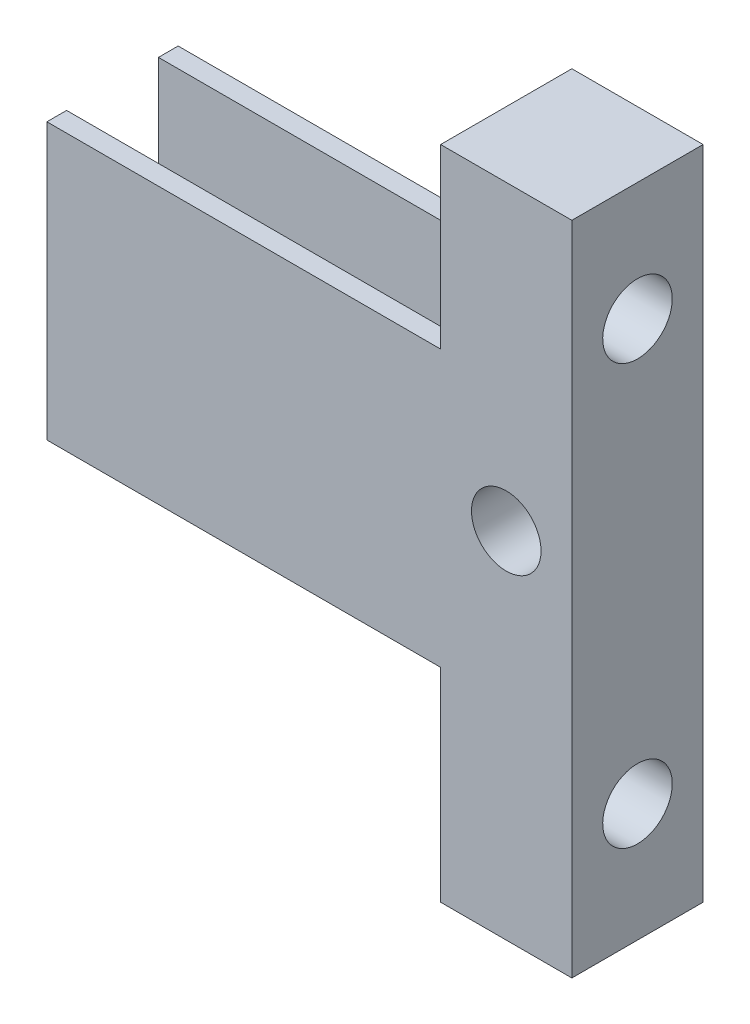
ISO-10303-21;
HEADER;
FILE_DESCRIPTION(('STEP AP214'),'2;1');
FILE_NAME('part.step','',(''),(''),'','','');
FILE_SCHEMA(('AUTOMOTIVE_DESIGN { 1 0 10303 214 1 1 1 1 }'));
ENDSEC;
DATA;
#1=APPLICATION_CONTEXT('core data for automotive mechanical design processes');
#2=APPLICATION_PROTOCOL_DEFINITION('international standard','automotive_design',2000,#1);
#3=PRODUCT_CONTEXT('',#1,'mechanical');
#4=PRODUCT('Part','Part','',(#3));
#5=PRODUCT_RELATED_PRODUCT_CATEGORY('part','',(#4));
#6=PRODUCT_DEFINITION_FORMATION('','',#4);
#7=PRODUCT_DEFINITION_CONTEXT('part definition',#1,'design');
#8=PRODUCT_DEFINITION('design','',#6,#7);
#9=PRODUCT_DEFINITION_SHAPE('','',#8);
#10=(LENGTH_UNIT() NAMED_UNIT(*) SI_UNIT(.MILLI.,.METRE.));
#11=(NAMED_UNIT(*) PLANE_ANGLE_UNIT() SI_UNIT($,.RADIAN.));
#12=(NAMED_UNIT(*) SI_UNIT($,.STERADIAN.) SOLID_ANGLE_UNIT());
#13=UNCERTAINTY_MEASURE_WITH_UNIT(LENGTH_MEASURE(1.E-05),#10,'distance_accuracy_value','');
#14=(GEOMETRIC_REPRESENTATION_CONTEXT(3) GLOBAL_UNCERTAINTY_ASSIGNED_CONTEXT((#13)) GLOBAL_UNIT_ASSIGNED_CONTEXT((#10,
#11,#12)) REPRESENTATION_CONTEXT('',''));
#15=CARTESIAN_POINT('',(0.,0.,0.));
#16=DIRECTION('',(0.,0.,1.));
#17=DIRECTION('',(1.,0.,0.));
#18=AXIS2_PLACEMENT_3D('',#15,#16,#17);
#19=CARTESIAN_POINT('',(0.,0.,10.));
#20=DIRECTION('',(-1.,0.,0.));
#21=DIRECTION('',(0.,-1.,0.));
#22=AXIS2_PLACEMENT_3D('',#19,#20,#21);
#23=PLANE('',#22);
#24=CARTESIAN_POINT('',(0.,41.,5.));
#25=DIRECTION('',(-1.,0.,0.));
#26=DIRECTION('',(0.,-1.,0.));
#27=AXIS2_PLACEMENT_3D('',#24,#25,#26);
#28=CIRCLE('',#27,2.65);
#29=CARTESIAN_POINT('',(0.,38.35,5.));
#30=VERTEX_POINT('',#29);
#31=EDGE_CURVE('E184',#30,#30,#28,.T.);
#32=ORIENTED_EDGE('',*,*,#31,.F.);
#33=EDGE_LOOP('',(#32));
#34=FACE_BOUND('',#33,.T.);
#35=CARTESIAN_POINT('',(0.,9.,5.));
#36=DIRECTION('',(-1.,0.,0.));
#37=DIRECTION('',(0.,-1.,0.));
#38=AXIS2_PLACEMENT_3D('',#35,#36,#37);
#39=CIRCLE('',#38,2.65);
#40=CARTESIAN_POINT('',(0.,6.35,5.));
#41=VERTEX_POINT('',#40);
#42=EDGE_CURVE('E179',#41,#41,#39,.T.);
#43=ORIENTED_EDGE('',*,*,#42,.F.);
#44=EDGE_LOOP('',(#43));
#45=FACE_BOUND('',#44,.T.);
#46=DIRECTION('',(0.,1.,0.));
#47=VECTOR('',#46,1.);
#48=CARTESIAN_POINT('',(0.,0.,0.));
#49=LINE('',#48,#47);
#50=CARTESIAN_POINT('',(0.,36.5,0.));
#51=VERTEX_POINT('',#50);
#52=CARTESIAN_POINT('',(0.,50.,0.));
#53=VERTEX_POINT('',#52);
#54=EDGE_CURVE('E215',#51,#53,#49,.T.);
#55=ORIENTED_EDGE('',*,*,#54,.F.);
#56=DIRECTION('',(0.,0.,-1.));
#57=VECTOR('',#56,1.);
#58=CARTESIAN_POINT('',(0.,36.5,0.));
#59=LINE('',#58,#57);
#60=CARTESIAN_POINT('',(0.,36.5,1.5));
#61=VERTEX_POINT('',#60);
#62=EDGE_CURVE('E52',#61,#51,#59,.T.);
#63=ORIENTED_EDGE('',*,*,#62,.F.);
#64=DIRECTION('',(0.,1.,0.));
#65=VECTOR('',#64,1.);
#66=CARTESIAN_POINT('',(0.,36.5,1.5));
#67=LINE('',#66,#65);
#68=CARTESIAN_POINT('',(0.,15.5,1.5));
#69=VERTEX_POINT('',#68);
#70=EDGE_CURVE('E144',#69,#61,#67,.T.);
#71=ORIENTED_EDGE('',*,*,#70,.F.);
#72=DIRECTION('',(0.,0.,1.));
#73=VECTOR('',#72,1.);
#74=CARTESIAN_POINT('',(0.,15.5,1.5));
#75=LINE('',#74,#73);
#76=CARTESIAN_POINT('',(0.,15.5,0.));
#77=VERTEX_POINT('',#76);
#78=EDGE_CURVE('E400',#77,#69,#75,.T.);
#79=ORIENTED_EDGE('',*,*,#78,.F.);
#80=CARTESIAN_POINT('',(0.,0.,0.));
#81=VERTEX_POINT('',#80);
#82=EDGE_CURVE('E216',#81,#77,#49,.T.);
#83=ORIENTED_EDGE('',*,*,#82,.F.);
#84=DIRECTION('',(0.,0.,-1.));
#85=VECTOR('',#84,1.);
#86=CARTESIAN_POINT('',(0.,0.,10.));
#87=LINE('',#86,#85);
#88=CARTESIAN_POINT('',(0.,0.,10.));
#89=VERTEX_POINT('',#88);
#90=EDGE_CURVE('E221',#89,#81,#87,.T.);
#91=ORIENTED_EDGE('',*,*,#90,.F.);
#92=DIRECTION('',(0.,1.,0.));
#93=VECTOR('',#92,1.);
#94=CARTESIAN_POINT('',(0.,0.,10.));
#95=LINE('',#94,#93);
#96=CARTESIAN_POINT('',(0.,15.5,10.));
#97=VERTEX_POINT('',#96);
#98=EDGE_CURVE('E206',#89,#97,#95,.T.);
#99=ORIENTED_EDGE('',*,*,#98,.T.);
#100=DIRECTION('',(0.,0.,1.));
#101=VECTOR('',#100,1.);
#102=CARTESIAN_POINT('',(0.,15.5,8.5));
#103=LINE('',#102,#101);
#104=CARTESIAN_POINT('',(0.,15.5,8.5));
#105=VERTEX_POINT('',#104);
#106=EDGE_CURVE('E159',#105,#97,#103,.T.);
#107=ORIENTED_EDGE('',*,*,#106,.F.);
#108=DIRECTION('',(0.,-1.,0.));
#109=VECTOR('',#108,1.);
#110=CARTESIAN_POINT('',(0.,36.5,8.5));
#111=LINE('',#110,#109);
#112=CARTESIAN_POINT('',(0.,36.5,8.5));
#113=VERTEX_POINT('',#112);
#114=EDGE_CURVE('E60',#113,#105,#111,.T.);
#115=ORIENTED_EDGE('',*,*,#114,.F.);
#116=DIRECTION('',(0.,0.,-1.));
#117=VECTOR('',#116,1.);
#118=CARTESIAN_POINT('',(0.,36.5,10.));
#119=LINE('',#118,#117);
#120=CARTESIAN_POINT('',(0.,36.5,10.));
#121=VERTEX_POINT('',#120);
#122=EDGE_CURVE('E147',#121,#113,#119,.T.);
#123=ORIENTED_EDGE('',*,*,#122,.F.);
#124=CARTESIAN_POINT('',(0.,50.,10.));
#125=VERTEX_POINT('',#124);
#126=EDGE_CURVE('E205',#121,#125,#95,.T.);
#127=ORIENTED_EDGE('',*,*,#126,.T.);
#128=DIRECTION('',(0.,0.,-1.));
#129=VECTOR('',#128,1.);
#130=CARTESIAN_POINT('',(0.,50.,10.));
#131=LINE('',#130,#129);
#132=EDGE_CURVE('E44',#125,#53,#131,.T.);
#133=ORIENTED_EDGE('',*,*,#132,.T.);
#134=EDGE_LOOP('',(#55,#63,#71,#79,#83,#91,#99,#107,#115,#123,#127,#133));
#135=FACE_BOUND('',#134,.T.);
#136=ADVANCED_FACE('F35',(#34,#45,#135),#23,.T.);
#137=CARTESIAN_POINT('',(9.99999999999999,50.,10.));
#138=DIRECTION('',(1.,0.,0.));
#139=DIRECTION('',(0.,1.,0.));
#140=AXIS2_PLACEMENT_3D('',#137,#138,#139);
#141=PLANE('',#140);
#142=CARTESIAN_POINT('',(10.,41.,5.));
#143=DIRECTION('',(-1.,0.,0.));
#144=DIRECTION('',(0.,-1.,0.));
#145=AXIS2_PLACEMENT_3D('',#142,#143,#144);
#146=CIRCLE('',#145,2.65);
#147=CARTESIAN_POINT('',(10.,38.35,5.));
#148=VERTEX_POINT('',#147);
#149=EDGE_CURVE('E180',#148,#148,#146,.T.);
#150=ORIENTED_EDGE('',*,*,#149,.T.);
#151=EDGE_LOOP('',(#150));
#152=FACE_BOUND('',#151,.T.);
#153=CARTESIAN_POINT('',(10.,9.,5.));
#154=DIRECTION('',(-1.,0.,0.));
#155=DIRECTION('',(0.,-1.,0.));
#156=AXIS2_PLACEMENT_3D('',#153,#154,#155);
#157=CIRCLE('',#156,2.65);
#158=CARTESIAN_POINT('',(10.,6.35,5.));
#159=VERTEX_POINT('',#158);
#160=EDGE_CURVE('E187',#159,#159,#157,.T.);
#161=ORIENTED_EDGE('',*,*,#160,.T.);
#162=EDGE_LOOP('',(#161));
#163=FACE_BOUND('',#162,.T.);
#164=DIRECTION('',(0.,-1.,0.));
#165=VECTOR('',#164,1.);
#166=CARTESIAN_POINT('',(9.99999999999999,50.,0.));
#167=LINE('',#166,#165);
#168=CARTESIAN_POINT('',(9.99999999999999,50.,0.));
#169=VERTEX_POINT('',#168);
#170=CARTESIAN_POINT('',(10.,0.,0.));
#171=VERTEX_POINT('',#170);
#172=EDGE_CURVE('E195',#169,#171,#167,.T.);
#173=ORIENTED_EDGE('',*,*,#172,.F.);
#174=DIRECTION('',(0.,0.,-1.));
#175=VECTOR('',#174,1.);
#176=CARTESIAN_POINT('',(9.99999999999999,50.,10.));
#177=LINE('',#176,#175);
#178=CARTESIAN_POINT('',(9.99999999999999,50.,10.));
#179=VERTEX_POINT('',#178);
#180=EDGE_CURVE('E11',#179,#169,#177,.T.);
#181=ORIENTED_EDGE('',*,*,#180,.F.);
#182=DIRECTION('',(0.,-1.,0.));
#183=VECTOR('',#182,1.);
#184=CARTESIAN_POINT('',(9.99999999999999,50.,10.));
#185=LINE('',#184,#183);
#186=CARTESIAN_POINT('',(10.,0.,10.));
#187=VERTEX_POINT('',#186);
#188=EDGE_CURVE('E198',#179,#187,#185,.T.);
#189=ORIENTED_EDGE('',*,*,#188,.T.);
#190=DIRECTION('',(0.,0.,-1.));
#191=VECTOR('',#190,1.);
#192=CARTESIAN_POINT('',(10.,0.,10.));
#193=LINE('',#192,#191);
#194=EDGE_CURVE('E39',#187,#171,#193,.T.);
#195=ORIENTED_EDGE('',*,*,#194,.T.);
#196=EDGE_LOOP('',(#173,#181,#189,#195));
#197=FACE_BOUND('',#196,.T.);
#198=ADVANCED_FACE('F37',(#152,#163,#197),#141,.T.);
#199=CARTESIAN_POINT('',(0.,50.,10.));
#200=DIRECTION('',(0.,1.,0.));
#201=DIRECTION('',(0.,0.,1.));
#202=AXIS2_PLACEMENT_3D('',#199,#200,#201);
#203=PLANE('',#202);
#204=DIRECTION('',(1.,0.,0.));
#205=VECTOR('',#204,1.);
#206=CARTESIAN_POINT('',(0.,50.,0.));
#207=LINE('',#206,#205);
#208=EDGE_CURVE('E202',#53,#169,#207,.T.);
#209=ORIENTED_EDGE('',*,*,#208,.F.);
#210=ORIENTED_EDGE('',*,*,#132,.F.);
#211=DIRECTION('',(1.,0.,0.));
#212=VECTOR('',#211,1.);
#213=CARTESIAN_POINT('',(0.,50.,10.));
#214=LINE('',#213,#212);
#215=EDGE_CURVE('E208',#125,#179,#214,.T.);
#216=ORIENTED_EDGE('',*,*,#215,.T.);
#217=ORIENTED_EDGE('',*,*,#180,.T.);
#218=EDGE_LOOP('',(#209,#210,#216,#217));
#219=FACE_BOUND('',#218,.T.);
#220=ADVANCED_FACE('F233',(#219),#203,.T.);
#221=CARTESIAN_POINT('',(10.,0.,10.));
#222=DIRECTION('',(0.,-1.,0.));
#223=DIRECTION('',(1.,0.,0.));
#224=AXIS2_PLACEMENT_3D('',#221,#222,#223);
#225=PLANE('',#224);
#226=DIRECTION('',(-1.,0.,0.));
#227=VECTOR('',#226,1.);
#228=CARTESIAN_POINT('',(10.,0.,0.));
#229=LINE('',#228,#227);
#230=EDGE_CURVE('E212',#171,#81,#229,.T.);
#231=ORIENTED_EDGE('',*,*,#230,.F.);
#232=ORIENTED_EDGE('',*,*,#194,.F.);
#233=DIRECTION('',(-1.,0.,0.));
#234=VECTOR('',#233,1.);
#235=CARTESIAN_POINT('',(10.,0.,10.));
#236=LINE('',#235,#234);
#237=EDGE_CURVE('E201',#187,#89,#236,.T.);
#238=ORIENTED_EDGE('',*,*,#237,.T.);
#239=ORIENTED_EDGE('',*,*,#90,.T.);
#240=EDGE_LOOP('',(#231,#232,#238,#239));
#241=FACE_BOUND('',#240,.T.);
#242=ADVANCED_FACE('F229',(#241),#225,.T.);
#243=CARTESIAN_POINT('',(0.,0.,10.));
#244=DIRECTION('',(0.,0.,-1.));
#245=DIRECTION('',(-1.,0.,0.));
#246=AXIS2_PLACEMENT_3D('',#243,#244,#245);
#247=PLANE('',#246);
#248=CARTESIAN_POINT('',(4.99999999999999,27.,10.));
#249=DIRECTION('',(0.,0.,1.));
#250=DIRECTION('',(1.,0.,0.));
#251=AXIS2_PLACEMENT_3D('',#248,#249,#250);
#252=CIRCLE('',#251,2.65);
#253=CARTESIAN_POINT('',(7.64999999999999,27.,10.));
#254=VERTEX_POINT('',#253);
#255=EDGE_CURVE('E183',#254,#254,#252,.T.);
#256=ORIENTED_EDGE('',*,*,#255,.F.);
#257=EDGE_LOOP('',(#256));
#258=FACE_BOUND('',#257,.T.);
#259=ORIENTED_EDGE('',*,*,#188,.F.);
#260=ORIENTED_EDGE('',*,*,#215,.F.);
#261=ORIENTED_EDGE('',*,*,#126,.F.);
#262=DIRECTION('',(1.,0.,0.));
#263=VECTOR('',#262,1.);
#264=CARTESIAN_POINT('',(-30.,36.5,10.));
#265=LINE('',#264,#263);
#266=CARTESIAN_POINT('',(-30.,36.5,10.));
#267=VERTEX_POINT('',#266);
#268=EDGE_CURVE('E164',#267,#121,#265,.T.);
#269=ORIENTED_EDGE('',*,*,#268,.F.);
#270=DIRECTION('',(0.,1.,0.));
#271=VECTOR('',#270,1.);
#272=CARTESIAN_POINT('',(-30.,15.5,10.));
#273=LINE('',#272,#271);
#274=CARTESIAN_POINT('',(-30.,15.5,10.));
#275=VERTEX_POINT('',#274);
#276=EDGE_CURVE('E163',#275,#267,#273,.T.);
#277=ORIENTED_EDGE('',*,*,#276,.F.);
#278=DIRECTION('',(1.,0.,0.));
#279=VECTOR('',#278,1.);
#280=CARTESIAN_POINT('',(-30.,15.5,10.));
#281=LINE('',#280,#279);
#282=EDGE_CURVE('E171',#275,#97,#281,.T.);
#283=ORIENTED_EDGE('',*,*,#282,.T.);
#284=ORIENTED_EDGE('',*,*,#98,.F.);
#285=ORIENTED_EDGE('',*,*,#237,.F.);
#286=EDGE_LOOP('',(#259,#260,#261,#269,#277,#283,#284,#285));
#287=FACE_BOUND('',#286,.T.);
#288=ADVANCED_FACE('F236',(#258,#287),#247,.F.);
#289=CARTESIAN_POINT('',(0.,0.,0.));
#290=DIRECTION('',(0.,0.,-1.));
#291=DIRECTION('',(-1.,0.,0.));
#292=AXIS2_PLACEMENT_3D('',#289,#290,#291);
#293=PLANE('',#292);
#294=CARTESIAN_POINT('',(4.99999999999999,27.,0.));
#295=DIRECTION('',(0.,0.,1.));
#296=DIRECTION('',(1.,0.,0.));
#297=AXIS2_PLACEMENT_3D('',#294,#295,#296);
#298=CIRCLE('',#297,2.65);
#299=CARTESIAN_POINT('',(7.64999999999999,27.,0.));
#300=VERTEX_POINT('',#299);
#301=EDGE_CURVE('E192',#300,#300,#298,.T.);
#302=ORIENTED_EDGE('',*,*,#301,.T.);
#303=EDGE_LOOP('',(#302));
#304=FACE_BOUND('',#303,.T.);
#305=ORIENTED_EDGE('',*,*,#172,.T.);
#306=ORIENTED_EDGE('',*,*,#230,.T.);
#307=ORIENTED_EDGE('',*,*,#82,.T.);
#308=DIRECTION('',(1.,0.,0.));
#309=VECTOR('',#308,1.);
#310=CARTESIAN_POINT('',(-30.,15.5,0.));
#311=LINE('',#310,#309);
#312=CARTESIAN_POINT('',(-30.,15.5,0.));
#313=VERTEX_POINT('',#312);
#314=EDGE_CURVE('E133',#313,#77,#311,.T.);
#315=ORIENTED_EDGE('',*,*,#314,.F.);
#316=DIRECTION('',(0.,-1.,0.));
#317=VECTOR('',#316,1.);
#318=CARTESIAN_POINT('',(-30.,15.5,0.));
#319=LINE('',#318,#317);
#320=CARTESIAN_POINT('',(-30.,36.5,0.));
#321=VERTEX_POINT('',#320);
#322=EDGE_CURVE('E126',#321,#313,#319,.T.);
#323=ORIENTED_EDGE('',*,*,#322,.F.);
#324=DIRECTION('',(1.,0.,0.));
#325=VECTOR('',#324,1.);
#326=CARTESIAN_POINT('',(-30.,36.5,0.));
#327=LINE('',#326,#325);
#328=EDGE_CURVE('E130',#321,#51,#327,.T.);
#329=ORIENTED_EDGE('',*,*,#328,.T.);
#330=ORIENTED_EDGE('',*,*,#54,.T.);
#331=ORIENTED_EDGE('',*,*,#208,.T.);
#332=EDGE_LOOP('',(#305,#306,#307,#315,#323,#329,#330,#331));
#333=FACE_BOUND('',#332,.T.);
#334=ADVANCED_FACE('F129',(#304,#333),#293,.T.);
#335=CARTESIAN_POINT('',(4.99999999999999,27.,0.));
#336=DIRECTION('',(0.,0.,1.));
#337=DIRECTION('',(1.,0.,0.));
#338=AXIS2_PLACEMENT_3D('',#335,#336,#337);
#339=CYLINDRICAL_SURFACE('',#338,2.65);
#340=ORIENTED_EDGE('',*,*,#301,.F.);
#341=EDGE_LOOP('',(#340));
#342=FACE_BOUND('',#341,.T.);
#343=ORIENTED_EDGE('',*,*,#255,.T.);
#344=EDGE_LOOP('',(#343));
#345=FACE_BOUND('',#344,.T.);
#346=ADVANCED_FACE('F293',(#342,#345),#339,.F.);
#347=CARTESIAN_POINT('',(10.,9.,5.));
#348=DIRECTION('',(-1.,0.,0.));
#349=DIRECTION('',(0.,-1.,0.));
#350=AXIS2_PLACEMENT_3D('',#347,#348,#349);
#351=CYLINDRICAL_SURFACE('',#350,2.65);
#352=ORIENTED_EDGE('',*,*,#160,.F.);
#353=EDGE_LOOP('',(#352));
#354=FACE_BOUND('',#353,.T.);
#355=ORIENTED_EDGE('',*,*,#42,.T.);
#356=EDGE_LOOP('',(#355));
#357=FACE_BOUND('',#356,.T.);
#358=ADVANCED_FACE('F297',(#354,#357),#351,.F.);
#359=CARTESIAN_POINT('',(10.,41.,5.));
#360=DIRECTION('',(-1.,0.,0.));
#361=DIRECTION('',(0.,-1.,0.));
#362=AXIS2_PLACEMENT_3D('',#359,#360,#361);
#363=CYLINDRICAL_SURFACE('',#362,2.65);
#364=ORIENTED_EDGE('',*,*,#149,.F.);
#365=EDGE_LOOP('',(#364));
#366=FACE_BOUND('',#365,.T.);
#367=ORIENTED_EDGE('',*,*,#31,.T.);
#368=EDGE_LOOP('',(#367));
#369=FACE_BOUND('',#368,.T.);
#370=ADVANCED_FACE('F302',(#366,#369),#363,.F.);
#371=CARTESIAN_POINT('',(-30.,36.5,10.));
#372=DIRECTION('',(0.,-1.,0.));
#373=DIRECTION('',(1.,0.,0.));
#374=AXIS2_PLACEMENT_3D('',#371,#372,#373);
#375=PLANE('',#374);
#376=ORIENTED_EDGE('',*,*,#122,.T.);
#377=DIRECTION('',(1.,0.,0.));
#378=VECTOR('',#377,1.);
#379=CARTESIAN_POINT('',(-30.,36.5,8.5));
#380=LINE('',#379,#378);
#381=CARTESIAN_POINT('',(-30.,36.5,8.5));
#382=VERTEX_POINT('',#381);
#383=EDGE_CURVE('E177',#382,#113,#380,.T.);
#384=ORIENTED_EDGE('',*,*,#383,.F.);
#385=DIRECTION('',(0.,0.,-1.));
#386=VECTOR('',#385,1.);
#387=CARTESIAN_POINT('',(-30.,36.5,10.));
#388=LINE('',#387,#386);
#389=EDGE_CURVE('E155',#267,#382,#388,.T.);
#390=ORIENTED_EDGE('',*,*,#389,.F.);
#391=ORIENTED_EDGE('',*,*,#268,.T.);
#392=EDGE_LOOP('',(#376,#384,#390,#391));
#393=FACE_BOUND('',#392,.T.);
#394=ADVANCED_FACE('F250',(#393),#375,.F.);
#395=CARTESIAN_POINT('',(-30.,36.5,8.5));
#396=DIRECTION('',(0.,0.,1.));
#397=DIRECTION('',(0.,-1.,0.));
#398=AXIS2_PLACEMENT_3D('',#395,#396,#397);
#399=PLANE('',#398);
#400=ORIENTED_EDGE('',*,*,#114,.T.);
#401=DIRECTION('',(1.,0.,0.));
#402=VECTOR('',#401,1.);
#403=CARTESIAN_POINT('',(-30.,15.5,8.5));
#404=LINE('',#403,#402);
#405=CARTESIAN_POINT('',(-30.,15.5,8.5));
#406=VERTEX_POINT('',#405);
#407=EDGE_CURVE('E174',#406,#105,#404,.T.);
#408=ORIENTED_EDGE('',*,*,#407,.F.);
#409=DIRECTION('',(0.,-1.,0.));
#410=VECTOR('',#409,1.);
#411=CARTESIAN_POINT('',(-30.,36.5,8.5));
#412=LINE('',#411,#410);
#413=EDGE_CURVE('E158',#382,#406,#412,.T.);
#414=ORIENTED_EDGE('',*,*,#413,.F.);
#415=ORIENTED_EDGE('',*,*,#383,.T.);
#416=EDGE_LOOP('',(#400,#408,#414,#415));
#417=FACE_BOUND('',#416,.T.);
#418=ADVANCED_FACE('F246',(#417),#399,.F.);
#419=CARTESIAN_POINT('',(-30.,15.5,8.5));
#420=DIRECTION('',(0.,1.,0.));
#421=DIRECTION('',(0.,0.,1.));
#422=AXIS2_PLACEMENT_3D('',#419,#420,#421);
#423=PLANE('',#422);
#424=ORIENTED_EDGE('',*,*,#106,.T.);
#425=ORIENTED_EDGE('',*,*,#282,.F.);
#426=DIRECTION('',(0.,0.,1.));
#427=VECTOR('',#426,1.);
#428=CARTESIAN_POINT('',(-30.,15.5,8.5));
#429=LINE('',#428,#427);
#430=EDGE_CURVE('E161',#406,#275,#429,.T.);
#431=ORIENTED_EDGE('',*,*,#430,.F.);
#432=ORIENTED_EDGE('',*,*,#407,.T.);
#433=EDGE_LOOP('',(#424,#425,#431,#432));
#434=FACE_BOUND('',#433,.T.);
#435=ADVANCED_FACE('F242',(#434),#423,.F.);
#436=CARTESIAN_POINT('',(-30.,0.,0.));
#437=DIRECTION('',(-1.,0.,0.));
#438=DIRECTION('',(0.,-1.,0.));
#439=AXIS2_PLACEMENT_3D('',#436,#437,#438);
#440=PLANE('',#439);
#441=ORIENTED_EDGE('',*,*,#389,.T.);
#442=ORIENTED_EDGE('',*,*,#413,.T.);
#443=ORIENTED_EDGE('',*,*,#430,.T.);
#444=ORIENTED_EDGE('',*,*,#276,.T.);
#445=EDGE_LOOP('',(#441,#442,#443,#444));
#446=FACE_BOUND('',#445,.T.);
#447=ADVANCED_FACE('F253',(#446),#440,.T.);
#448=CARTESIAN_POINT('',(-30.,36.5,0.));
#449=DIRECTION('',(0.,-1.,0.));
#450=DIRECTION('',(1.,0.,0.));
#451=AXIS2_PLACEMENT_3D('',#448,#449,#450);
#452=PLANE('',#451);
#453=ORIENTED_EDGE('',*,*,#62,.T.);
#454=ORIENTED_EDGE('',*,*,#328,.F.);
#455=DIRECTION('',(0.,0.,-1.));
#456=VECTOR('',#455,1.);
#457=CARTESIAN_POINT('',(-30.,36.5,0.));
#458=LINE('',#457,#456);
#459=CARTESIAN_POINT('',(-30.,36.5,1.5));
#460=VERTEX_POINT('',#459);
#461=EDGE_CURVE('E137',#460,#321,#458,.T.);
#462=ORIENTED_EDGE('',*,*,#461,.F.);
#463=DIRECTION('',(1.,0.,0.));
#464=VECTOR('',#463,1.);
#465=CARTESIAN_POINT('',(-30.,36.5,1.5));
#466=LINE('',#465,#464);
#467=EDGE_CURVE('E397',#460,#61,#466,.T.);
#468=ORIENTED_EDGE('',*,*,#467,.T.);
#469=EDGE_LOOP('',(#453,#454,#462,#468));
#470=FACE_BOUND('',#469,.T.);
#471=ADVANCED_FACE('F146',(#470),#452,.F.);
#472=CARTESIAN_POINT('',(-30.,15.5,1.5));
#473=DIRECTION('',(0.,1.,0.));
#474=DIRECTION('',(-1.,0.,0.));
#475=AXIS2_PLACEMENT_3D('',#472,#473,#474);
#476=PLANE('',#475);
#477=ORIENTED_EDGE('',*,*,#78,.T.);
#478=DIRECTION('',(1.,0.,0.));
#479=VECTOR('',#478,1.);
#480=CARTESIAN_POINT('',(-30.,15.5,1.5));
#481=LINE('',#480,#479);
#482=CARTESIAN_POINT('',(-30.,15.5,1.5));
#483=VERTEX_POINT('',#482);
#484=EDGE_CURVE('E151',#483,#69,#481,.T.);
#485=ORIENTED_EDGE('',*,*,#484,.F.);
#486=DIRECTION('',(0.,0.,1.));
#487=VECTOR('',#486,1.);
#488=CARTESIAN_POINT('',(-30.,15.5,1.5));
#489=LINE('',#488,#487);
#490=EDGE_CURVE('E136',#313,#483,#489,.T.);
#491=ORIENTED_EDGE('',*,*,#490,.F.);
#492=ORIENTED_EDGE('',*,*,#314,.T.);
#493=EDGE_LOOP('',(#477,#485,#491,#492));
#494=FACE_BOUND('',#493,.T.);
#495=ADVANCED_FACE('F260',(#494),#476,.F.);
#496=CARTESIAN_POINT('',(-30.,36.5,1.5));
#497=DIRECTION('',(0.,0.,-1.));
#498=DIRECTION('',(0.,1.,0.));
#499=AXIS2_PLACEMENT_3D('',#496,#497,#498);
#500=PLANE('',#499);
#501=ORIENTED_EDGE('',*,*,#70,.T.);
#502=ORIENTED_EDGE('',*,*,#467,.F.);
#503=DIRECTION('',(0.,1.,0.));
#504=VECTOR('',#503,1.);
#505=CARTESIAN_POINT('',(-30.,36.5,1.5));
#506=LINE('',#505,#504);
#507=EDGE_CURVE('E142',#483,#460,#506,.T.);
#508=ORIENTED_EDGE('',*,*,#507,.F.);
#509=ORIENTED_EDGE('',*,*,#484,.T.);
#510=EDGE_LOOP('',(#501,#502,#508,#509));
#511=FACE_BOUND('',#510,.T.);
#512=ADVANCED_FACE('F373',(#511),#500,.F.);
#513=CARTESIAN_POINT('',(-30.,0.,0.));
#514=DIRECTION('',(1.,0.,0.));
#515=DIRECTION('',(0.,1.,0.));
#516=AXIS2_PLACEMENT_3D('',#513,#514,#515);
#517=PLANE('',#516);
#518=ORIENTED_EDGE('',*,*,#461,.T.);
#519=ORIENTED_EDGE('',*,*,#322,.T.);
#520=ORIENTED_EDGE('',*,*,#490,.T.);
#521=ORIENTED_EDGE('',*,*,#507,.T.);
#522=EDGE_LOOP('',(#518,#519,#520,#521));
#523=FACE_BOUND('',#522,.T.);
#524=ADVANCED_FACE('F140',(#523),#517,.F.);
#525=CLOSED_SHELL('',(#136,#198,#220,#242,#288,#334,#346,#358,#370,#394,#418,#435,#447,#471,
#495,#512,#524));
#526=MANIFOLD_SOLID_BREP('B2',#525);
#527=ADVANCED_BREP_SHAPE_REPRESENTATION('',(#18,#526),#14);
#528=SHAPE_DEFINITION_REPRESENTATION(#9,#527);
ENDSEC;
END-ISO-10303-21;
